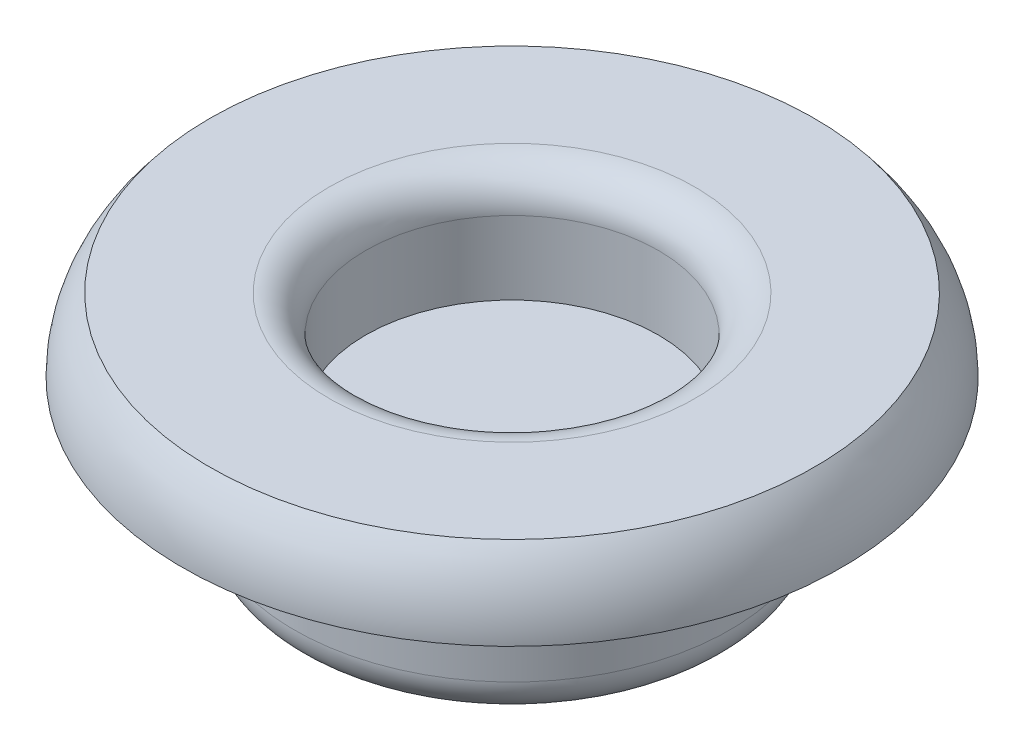
ISO-10303-21;
HEADER;
FILE_DESCRIPTION(('STEP AP214'),'2;1');
FILE_NAME('part.step','',(''),(''),'','','');
FILE_SCHEMA(('AUTOMOTIVE_DESIGN { 1 0 10303 214 1 1 1 1 }'));
ENDSEC;
DATA;
#1=APPLICATION_CONTEXT('core data for automotive mechanical design processes');
#2=APPLICATION_PROTOCOL_DEFINITION('international standard','automotive_design',2000,#1);
#3=PRODUCT_CONTEXT('',#1,'mechanical');
#4=PRODUCT('Part','Part','',(#3));
#5=PRODUCT_RELATED_PRODUCT_CATEGORY('part','',(#4));
#6=PRODUCT_DEFINITION_FORMATION('','',#4);
#7=PRODUCT_DEFINITION_CONTEXT('part definition',#1,'design');
#8=PRODUCT_DEFINITION('design','',#6,#7);
#9=PRODUCT_DEFINITION_SHAPE('','',#8);
#10=(LENGTH_UNIT() NAMED_UNIT(*) SI_UNIT(.MILLI.,.METRE.));
#11=(NAMED_UNIT(*) PLANE_ANGLE_UNIT() SI_UNIT($,.RADIAN.));
#12=(NAMED_UNIT(*) SI_UNIT($,.STERADIAN.) SOLID_ANGLE_UNIT());
#13=UNCERTAINTY_MEASURE_WITH_UNIT(LENGTH_MEASURE(1.E-05),#10,'distance_accuracy_value','');
#14=(GEOMETRIC_REPRESENTATION_CONTEXT(3) GLOBAL_UNCERTAINTY_ASSIGNED_CONTEXT((#13)) GLOBAL_UNIT_ASSIGNED_CONTEXT((#10,
#11,#12)) REPRESENTATION_CONTEXT('',''));
#15=CARTESIAN_POINT('',(0.,0.,0.));
#16=DIRECTION('',(0.,0.,1.));
#17=DIRECTION('',(1.,0.,0.));
#18=AXIS2_PLACEMENT_3D('',#15,#16,#17);
#19=CARTESIAN_POINT('',(0.,-6.,0.));
#20=DIRECTION('',(0.,1.,0.));
#21=DIRECTION('',(-1.,0.,0.));
#22=AXIS2_PLACEMENT_3D('',#19,#20,#21);
#23=PLANE('',#22);
#24=CARTESIAN_POINT('',(0.,-6.,0.));
#25=DIRECTION('',(0.,1.,0.));
#26=DIRECTION('',(-1.,0.,0.));
#27=AXIS2_PLACEMENT_3D('',#24,#25,#26);
#28=CIRCLE('',#27,4.95);
#29=CARTESIAN_POINT('',(-4.95,-6.,0.));
#30=VERTEX_POINT('',#29);
#31=EDGE_CURVE('E10',#30,#30,#28,.T.);
#32=ORIENTED_EDGE('',*,*,#31,.F.);
#33=EDGE_LOOP('',(#32));
#34=FACE_BOUND('',#33,.T.);
#35=ADVANCED_FACE('F37',(#34),#23,.F.);
#36=CARTESIAN_POINT('',(0.,-5.,0.));
#37=DIRECTION('',(0.,1.,0.));
#38=DIRECTION('',(-1.,0.,0.));
#39=AXIS2_PLACEMENT_3D('',#36,#37,#38);
#40=TOROIDAL_SURFACE('',#39,4.95,1.);
#41=CARTESIAN_POINT('',(0.,-5.,0.));
#42=DIRECTION('',(0.,1.,0.));
#43=DIRECTION('',(-1.,0.,0.));
#44=AXIS2_PLACEMENT_3D('',#41,#42,#43);
#45=CIRCLE('',#44,5.95);
#46=CARTESIAN_POINT('',(-5.95,-5.,0.));
#47=VERTEX_POINT('',#46);
#48=EDGE_CURVE('E44',#47,#47,#45,.T.);
#49=ORIENTED_EDGE('',*,*,#48,.F.);
#50=EDGE_LOOP('',(#49));
#51=FACE_BOUND('',#50,.T.);
#52=ORIENTED_EDGE('',*,*,#31,.T.);
#53=EDGE_LOOP('',(#52));
#54=FACE_BOUND('',#53,.T.);
#55=ADVANCED_FACE('F111',(#51,#54),#40,.T.);
#56=CARTESIAN_POINT('',(0.,0.,0.));
#57=DIRECTION('',(0.,1.,0.));
#58=DIRECTION('',(-1.,0.,0.));
#59=AXIS2_PLACEMENT_3D('',#56,#57,#58);
#60=CYLINDRICAL_SURFACE('',#59,5.95);
#61=CARTESIAN_POINT('',(0.,-2.,0.));
#62=DIRECTION('',(0.,1.,0.));
#63=DIRECTION('',(-1.,0.,0.));
#64=AXIS2_PLACEMENT_3D('',#61,#62,#63);
#65=CIRCLE('',#64,5.95);
#66=CARTESIAN_POINT('',(-5.95,-2.,0.));
#67=VERTEX_POINT('',#66);
#68=EDGE_CURVE('E49',#67,#67,#65,.T.);
#69=ORIENTED_EDGE('',*,*,#68,.F.);
#70=EDGE_LOOP('',(#69));
#71=FACE_BOUND('',#70,.T.);
#72=ORIENTED_EDGE('',*,*,#48,.T.);
#73=EDGE_LOOP('',(#72));
#74=FACE_BOUND('',#73,.T.);
#75=ADVANCED_FACE('F106',(#71,#74),#60,.T.);
#76=CARTESIAN_POINT('',(5.95,-2.,0.));
#77=DIRECTION('',(0.,1.,0.));
#78=DIRECTION('',(-1.,0.,0.));
#79=AXIS2_PLACEMENT_3D('',#76,#77,#78);
#80=PLANE('',#79);
#81=CARTESIAN_POINT('',(0.,-2.,0.));
#82=DIRECTION('',(0.,1.,0.));
#83=DIRECTION('',(-1.,0.,0.));
#84=AXIS2_PLACEMENT_3D('',#81,#82,#83);
#85=CIRCLE('',#84,9.);
#86=CARTESIAN_POINT('',(-9.,-2.,0.));
#87=VERTEX_POINT('',#86);
#88=EDGE_CURVE('E54',#87,#87,#85,.T.);
#89=ORIENTED_EDGE('',*,*,#88,.F.);
#90=EDGE_LOOP('',(#89));
#91=FACE_BOUND('',#90,.T.);
#92=ORIENTED_EDGE('',*,*,#68,.T.);
#93=EDGE_LOOP('',(#92));
#94=FACE_BOUND('',#93,.T.);
#95=ADVANCED_FACE('F100',(#91,#94),#80,.F.);
#96=CARTESIAN_POINT('',(0.,-2.,0.));
#97=DIRECTION('',(0.,1.,0.));
#98=DIRECTION('',(-1.,0.,0.));
#99=AXIS2_PLACEMENT_3D('',#96,#97,#98);
#100=TOROIDAL_SURFACE('',#99,5.95,3.05);
#101=CARTESIAN_POINT('',(0.,0.,0.));
#102=DIRECTION('',(0.,1.,0.));
#103=DIRECTION('',(-1.,0.,0.));
#104=AXIS2_PLACEMENT_3D('',#101,#102,#103);
#105=CIRCLE('',#104,8.25271578793389);
#106=CARTESIAN_POINT('',(-8.25271578793389,0.,0.));
#107=VERTEX_POINT('',#106);
#108=EDGE_CURVE('E60',#107,#107,#105,.T.);
#109=ORIENTED_EDGE('',*,*,#108,.F.);
#110=EDGE_LOOP('',(#109));
#111=FACE_BOUND('',#110,.T.);
#112=ORIENTED_EDGE('',*,*,#88,.T.);
#113=EDGE_LOOP('',(#112));
#114=FACE_BOUND('',#113,.T.);
#115=ADVANCED_FACE('F94',(#111,#114),#100,.T.);
#116=CARTESIAN_POINT('',(8.25271578793389,0.,0.));
#117=DIRECTION('',(0.,-1.,0.));
#118=DIRECTION('',(1.,0.,0.));
#119=AXIS2_PLACEMENT_3D('',#116,#117,#118);
#120=PLANE('',#119);
#121=CARTESIAN_POINT('',(0.,0.,0.));
#122=DIRECTION('',(0.,1.,0.));
#123=DIRECTION('',(-1.,0.,0.));
#124=AXIS2_PLACEMENT_3D('',#121,#122,#123);
#125=CIRCLE('',#124,5.00000000000001);
#126=CARTESIAN_POINT('',(-5.00000000000001,0.,0.));
#127=VERTEX_POINT('',#126);
#128=EDGE_CURVE('E64',#127,#127,#125,.T.);
#129=ORIENTED_EDGE('',*,*,#128,.F.);
#130=EDGE_LOOP('',(#129));
#131=FACE_BOUND('',#130,.T.);
#132=ORIENTED_EDGE('',*,*,#108,.T.);
#133=EDGE_LOOP('',(#132));
#134=FACE_BOUND('',#133,.T.);
#135=ADVANCED_FACE('F88',(#131,#134),#120,.F.);
#136=CARTESIAN_POINT('',(0.,-1.,0.));
#137=DIRECTION('',(0.,1.,0.));
#138=DIRECTION('',(-1.,0.,0.));
#139=AXIS2_PLACEMENT_3D('',#136,#137,#138);
#140=TOROIDAL_SURFACE('',#139,5.,1.);
#141=CARTESIAN_POINT('',(0.,-1.00000000000001,0.));
#142=DIRECTION('',(0.,1.,0.));
#143=DIRECTION('',(-1.,0.,0.));
#144=AXIS2_PLACEMENT_3D('',#141,#142,#143);
#145=CIRCLE('',#144,4.);
#146=CARTESIAN_POINT('',(-4.,-1.00000000000001,0.));
#147=VERTEX_POINT('',#146);
#148=EDGE_CURVE('E68',#147,#147,#145,.T.);
#149=ORIENTED_EDGE('',*,*,#148,.F.);
#150=EDGE_LOOP('',(#149));
#151=FACE_BOUND('',#150,.T.);
#152=ORIENTED_EDGE('',*,*,#128,.T.);
#153=EDGE_LOOP('',(#152));
#154=FACE_BOUND('',#153,.T.);
#155=ADVANCED_FACE('F82',(#151,#154),#140,.T.);
#156=CARTESIAN_POINT('',(0.,0.,0.));
#157=DIRECTION('',(0.,1.,0.));
#158=DIRECTION('',(-1.,0.,0.));
#159=AXIS2_PLACEMENT_3D('',#156,#157,#158);
#160=CYLINDRICAL_SURFACE('',#159,4.);
#161=CARTESIAN_POINT('',(0.,-3.,0.));
#162=DIRECTION('',(0.,1.,0.));
#163=DIRECTION('',(-1.,0.,0.));
#164=AXIS2_PLACEMENT_3D('',#161,#162,#163);
#165=CIRCLE('',#164,4.);
#166=CARTESIAN_POINT('',(-4.,-3.,0.));
#167=VERTEX_POINT('',#166);
#168=EDGE_CURVE('E72',#167,#167,#165,.T.);
#169=ORIENTED_EDGE('',*,*,#168,.F.);
#170=EDGE_LOOP('',(#169));
#171=FACE_BOUND('',#170,.T.);
#172=ORIENTED_EDGE('',*,*,#148,.T.);
#173=EDGE_LOOP('',(#172));
#174=FACE_BOUND('',#173,.T.);
#175=ADVANCED_FACE('F79',(#171,#174),#160,.F.);
#176=CARTESIAN_POINT('',(4.,-3.,0.));
#177=DIRECTION('',(0.,-1.,0.));
#178=DIRECTION('',(1.,0.,0.));
#179=AXIS2_PLACEMENT_3D('',#176,#177,#178);
#180=PLANE('',#179);
#181=ORIENTED_EDGE('',*,*,#168,.T.);
#182=EDGE_LOOP('',(#181));
#183=FACE_BOUND('',#182,.T.);
#184=ADVANCED_FACE('F77',(#183),#180,.F.);
#185=CLOSED_SHELL('',(#35,#55,#75,#95,#115,#135,#155,#175,#184));
#186=MANIFOLD_SOLID_BREP('B2',#185);
#187=ADVANCED_BREP_SHAPE_REPRESENTATION('',(#18,#186),#14);
#188=SHAPE_DEFINITION_REPRESENTATION(#9,#187);
ENDSEC;
END-ISO-10303-21;
